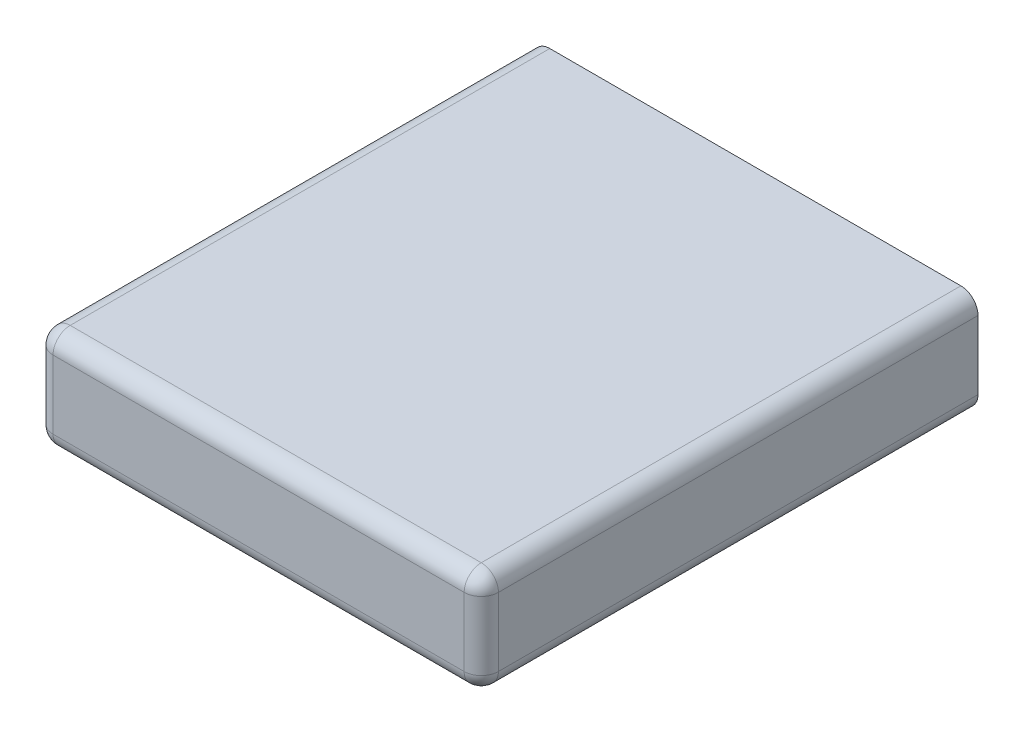
ISO-10303-21;
HEADER;
FILE_DESCRIPTION(('STEP AP214'),'2;1');
FILE_NAME('part.step','',(''),(''),'','','');
FILE_SCHEMA(('AUTOMOTIVE_DESIGN { 1 0 10303 214 1 1 1 1 }'));
ENDSEC;
DATA;
#1=APPLICATION_CONTEXT('core data for automotive mechanical design processes');
#2=APPLICATION_PROTOCOL_DEFINITION('international standard','automotive_design',2000,#1);
#3=PRODUCT_CONTEXT('',#1,'mechanical');
#4=PRODUCT('Part','Part','',(#3));
#5=PRODUCT_RELATED_PRODUCT_CATEGORY('part','',(#4));
#6=PRODUCT_DEFINITION_FORMATION('','',#4);
#7=PRODUCT_DEFINITION_CONTEXT('part definition',#1,'design');
#8=PRODUCT_DEFINITION('design','',#6,#7);
#9=PRODUCT_DEFINITION_SHAPE('','',#8);
#10=(LENGTH_UNIT() NAMED_UNIT(*) SI_UNIT(.MILLI.,.METRE.));
#11=(NAMED_UNIT(*) PLANE_ANGLE_UNIT() SI_UNIT($,.RADIAN.));
#12=(NAMED_UNIT(*) SI_UNIT($,.STERADIAN.) SOLID_ANGLE_UNIT());
#13=UNCERTAINTY_MEASURE_WITH_UNIT(LENGTH_MEASURE(1.E-05),#10,'distance_accuracy_value','');
#14=(GEOMETRIC_REPRESENTATION_CONTEXT(3) GLOBAL_UNCERTAINTY_ASSIGNED_CONTEXT((#13)) GLOBAL_UNIT_ASSIGNED_CONTEXT((#10,
#11,#12)) REPRESENTATION_CONTEXT('',''));
#15=CARTESIAN_POINT('',(0.,0.,0.));
#16=DIRECTION('',(0.,0.,1.));
#17=DIRECTION('',(1.,0.,0.));
#18=AXIS2_PLACEMENT_3D('',#15,#16,#17);
#19=CARTESIAN_POINT('',(12.,1.,21.5));
#20=DIRECTION('',(0.577350269189627,-0.577350269189628,0.577350269189622));
#21=DIRECTION('',(0.,0.707106781186544,0.707106781186551));
#22=AXIS2_PLACEMENT_3D('',#19,#20,#21);
#23=SPHERICAL_SURFACE('',#22,1.);
#24=CARTESIAN_POINT('',(12.5773502691896,0.422649730810372,22.0773502691896));
#25=VERTEX_POINT('',#24);
#26=VERTEX_LOOP('',#25);
#27=FACE_BOUND('',#26,.T.);
#28=CARTESIAN_POINT('',(12.,1.,21.5));
#29=DIRECTION('',(0.,0.,-1.));
#30=DIRECTION('',(-1.,0.,0.));
#31=AXIS2_PLACEMENT_3D('',#28,#29,#30);
#32=CIRCLE('',#31,1.);
#33=CARTESIAN_POINT('',(13.,1.,21.5));
#34=VERTEX_POINT('',#33);
#35=CARTESIAN_POINT('',(12.,0.,21.5));
#36=VERTEX_POINT('',#35);
#37=EDGE_CURVE('E112',#34,#36,#32,.T.);
#38=ORIENTED_EDGE('',*,*,#37,.F.);
#39=CARTESIAN_POINT('',(12.,1.,21.5));
#40=DIRECTION('',(0.,1.,0.));
#41=DIRECTION('',(0.,0.,1.));
#42=AXIS2_PLACEMENT_3D('',#39,#40,#41);
#43=CIRCLE('',#42,1.);
#44=CARTESIAN_POINT('',(12.,1.,22.5));
#45=VERTEX_POINT('',#44);
#46=EDGE_CURVE('E115',#45,#34,#43,.T.);
#47=ORIENTED_EDGE('',*,*,#46,.F.);
#48=CARTESIAN_POINT('',(12.,1.,21.5));
#49=DIRECTION('',(1.,0.,0.));
#50=DIRECTION('',(0.,0.,-1.));
#51=AXIS2_PLACEMENT_3D('',#48,#49,#50);
#52=CIRCLE('',#51,1.);
#53=EDGE_CURVE('E117',#36,#45,#52,.F.);
#54=ORIENTED_EDGE('',*,*,#53,.F.);
#55=EDGE_LOOP('',(#38,#47,#54));
#56=FACE_BOUND('',#55,.T.);
#57=ADVANCED_FACE('F17',(#27,#56),#23,.T.);
#58=CARTESIAN_POINT('',(-12.,1.,21.5));
#59=DIRECTION('',(-0.577350269189628,-0.577350269189627,0.577350269189622));
#60=DIRECTION('',(-0.707106781186547,0.707106781186548,0.));
#61=AXIS2_PLACEMENT_3D('',#58,#59,#60);
#62=SPHERICAL_SURFACE('',#61,1.);
#63=CARTESIAN_POINT('',(-12.5773502691896,0.422649730810373,22.0773502691896));
#64=VERTEX_POINT('',#63);
#65=VERTEX_LOOP('',#64);
#66=FACE_BOUND('',#65,.T.);
#67=CARTESIAN_POINT('',(-12.,1.,21.5));
#68=DIRECTION('',(0.,0.,1.));
#69=DIRECTION('',(1.,0.,0.));
#70=AXIS2_PLACEMENT_3D('',#67,#68,#69);
#71=CIRCLE('',#70,1.);
#72=CARTESIAN_POINT('',(-12.,0.,21.5));
#73=VERTEX_POINT('',#72);
#74=CARTESIAN_POINT('',(-13.,1.,21.5));
#75=VERTEX_POINT('',#74);
#76=EDGE_CURVE('E220',#73,#75,#71,.F.);
#77=ORIENTED_EDGE('',*,*,#76,.F.);
#78=CARTESIAN_POINT('',(-12.,1.,21.5));
#79=DIRECTION('',(1.,0.,0.));
#80=DIRECTION('',(0.,0.,-1.));
#81=AXIS2_PLACEMENT_3D('',#78,#79,#80);
#82=CIRCLE('',#81,1.);
#83=CARTESIAN_POINT('',(-12.,1.,22.5));
#84=VERTEX_POINT('',#83);
#85=EDGE_CURVE('E224',#84,#73,#82,.T.);
#86=ORIENTED_EDGE('',*,*,#85,.F.);
#87=CARTESIAN_POINT('',(-12.,1.,21.5));
#88=DIRECTION('',(0.,1.,0.));
#89=DIRECTION('',(0.,0.,1.));
#90=AXIS2_PLACEMENT_3D('',#87,#88,#89);
#91=CIRCLE('',#90,1.);
#92=EDGE_CURVE('E21',#75,#84,#91,.T.);
#93=ORIENTED_EDGE('',*,*,#92,.F.);
#94=EDGE_LOOP('',(#77,#86,#93));
#95=FACE_BOUND('',#94,.T.);
#96=ADVANCED_FACE('F110',(#66,#95),#62,.T.);
#97=CARTESIAN_POINT('',(-12.,0.,21.5));
#98=DIRECTION('',(0.,1.,0.));
#99=DIRECTION('',(0.,0.,1.));
#100=AXIS2_PLACEMENT_3D('',#97,#98,#99);
#101=CYLINDRICAL_SURFACE('',#100,1.);
#102=ORIENTED_EDGE('',*,*,#92,.T.);
#103=DIRECTION('',(0.,1.,0.));
#104=VECTOR('',#103,1.);
#105=CARTESIAN_POINT('',(-12.,0.,22.5));
#106=LINE('',#105,#104);
#107=CARTESIAN_POINT('',(-12.,5.,22.5));
#108=VERTEX_POINT('',#107);
#109=EDGE_CURVE('E216',#108,#84,#106,.F.);
#110=ORIENTED_EDGE('',*,*,#109,.F.);
#111=CARTESIAN_POINT('',(-12.,5.,21.5));
#112=DIRECTION('',(0.,1.,0.));
#113=DIRECTION('',(0.,0.,1.));
#114=AXIS2_PLACEMENT_3D('',#111,#112,#113);
#115=CIRCLE('',#114,1.);
#116=CARTESIAN_POINT('',(-13.,5.,21.5));
#117=VERTEX_POINT('',#116);
#118=EDGE_CURVE('E217',#117,#108,#115,.T.);
#119=ORIENTED_EDGE('',*,*,#118,.F.);
#120=DIRECTION('',(0.,1.,0.));
#121=VECTOR('',#120,1.);
#122=CARTESIAN_POINT('',(-13.,0.,21.5));
#123=LINE('',#122,#121);
#124=EDGE_CURVE('E133',#75,#117,#123,.T.);
#125=ORIENTED_EDGE('',*,*,#124,.F.);
#126=EDGE_LOOP('',(#102,#110,#119,#125));
#127=FACE_BOUND('',#126,.T.);
#128=ADVANCED_FACE('F185',(#127),#101,.T.);
#129=CARTESIAN_POINT('',(12.,0.,21.5));
#130=DIRECTION('',(0.,1.,0.));
#131=DIRECTION('',(0.,0.,1.));
#132=AXIS2_PLACEMENT_3D('',#129,#130,#131);
#133=CYLINDRICAL_SURFACE('',#132,1.);
#134=ORIENTED_EDGE('',*,*,#46,.T.);
#135=DIRECTION('',(0.,1.,0.));
#136=VECTOR('',#135,1.);
#137=CARTESIAN_POINT('',(13.,0.,21.5));
#138=LINE('',#137,#136);
#139=CARTESIAN_POINT('',(13.,5.,21.5));
#140=VERTEX_POINT('',#139);
#141=EDGE_CURVE('E132',#140,#34,#138,.F.);
#142=ORIENTED_EDGE('',*,*,#141,.F.);
#143=CARTESIAN_POINT('',(12.,5.,21.5));
#144=DIRECTION('',(0.,1.,0.));
#145=DIRECTION('',(0.,0.,1.));
#146=AXIS2_PLACEMENT_3D('',#143,#144,#145);
#147=CIRCLE('',#146,1.);
#148=CARTESIAN_POINT('',(12.,5.,22.5));
#149=VERTEX_POINT('',#148);
#150=EDGE_CURVE('E214',#149,#140,#147,.T.);
#151=ORIENTED_EDGE('',*,*,#150,.F.);
#152=DIRECTION('',(0.,1.,0.));
#153=VECTOR('',#152,1.);
#154=CARTESIAN_POINT('',(12.,0.,22.5));
#155=LINE('',#154,#153);
#156=EDGE_CURVE('E140',#45,#149,#155,.T.);
#157=ORIENTED_EDGE('',*,*,#156,.F.);
#158=EDGE_LOOP('',(#134,#142,#151,#157));
#159=FACE_BOUND('',#158,.T.);
#160=ADVANCED_FACE('F137',(#159),#133,.T.);
#161=CARTESIAN_POINT('',(-6.5,1.,21.5));
#162=DIRECTION('',(1.,0.,0.));
#163=DIRECTION('',(0.,0.,-1.));
#164=AXIS2_PLACEMENT_3D('',#161,#162,#163);
#165=CYLINDRICAL_SURFACE('',#164,1.);
#166=ORIENTED_EDGE('',*,*,#85,.T.);
#167=DIRECTION('',(1.,0.,0.));
#168=VECTOR('',#167,1.);
#169=CARTESIAN_POINT('',(0.,0.,21.5));
#170=LINE('',#169,#168);
#171=EDGE_CURVE('E146',#73,#36,#170,.T.);
#172=ORIENTED_EDGE('',*,*,#171,.T.);
#173=ORIENTED_EDGE('',*,*,#53,.T.);
#174=DIRECTION('',(1.,0.,0.));
#175=VECTOR('',#174,1.);
#176=CARTESIAN_POINT('',(-13.,1.,22.5));
#177=LINE('',#176,#175);
#178=EDGE_CURVE('E192',#84,#45,#177,.T.);
#179=ORIENTED_EDGE('',*,*,#178,.F.);
#180=EDGE_LOOP('',(#166,#172,#173,#179));
#181=FACE_BOUND('',#180,.T.);
#182=ADVANCED_FACE('F179',(#181),#165,.T.);
#183=CARTESIAN_POINT('',(12.,1.,15.25));
#184=DIRECTION('',(0.,0.,-1.));
#185=DIRECTION('',(-1.,0.,0.));
#186=AXIS2_PLACEMENT_3D('',#183,#184,#185);
#187=CYLINDRICAL_SURFACE('',#186,1.);
#188=ORIENTED_EDGE('',*,*,#37,.T.);
#189=DIRECTION('',(0.,0.,1.));
#190=VECTOR('',#189,1.);
#191=CARTESIAN_POINT('',(12.,0.,8.));
#192=LINE('',#191,#190);
#193=CARTESIAN_POINT('',(12.,0.,-6.5));
#194=VERTEX_POINT('',#193);
#195=EDGE_CURVE('E148',#36,#194,#192,.F.);
#196=ORIENTED_EDGE('',*,*,#195,.T.);
#197=CARTESIAN_POINT('',(12.,1.,-6.5));
#198=DIRECTION('',(0.,0.,-1.));
#199=DIRECTION('',(-1.,0.,0.));
#200=AXIS2_PLACEMENT_3D('',#197,#198,#199);
#201=CIRCLE('',#200,1.);
#202=CARTESIAN_POINT('',(13.,1.,-6.5));
#203=VERTEX_POINT('',#202);
#204=EDGE_CURVE('E123',#194,#203,#201,.F.);
#205=ORIENTED_EDGE('',*,*,#204,.T.);
#206=DIRECTION('',(0.,0.,-1.));
#207=VECTOR('',#206,1.);
#208=CARTESIAN_POINT('',(13.,1.,22.5));
#209=LINE('',#208,#207);
#210=EDGE_CURVE('E126',#34,#203,#209,.T.);
#211=ORIENTED_EDGE('',*,*,#210,.F.);
#212=EDGE_LOOP('',(#188,#196,#205,#211));
#213=FACE_BOUND('',#212,.T.);
#214=ADVANCED_FACE('F127',(#213),#187,.T.);
#215=CARTESIAN_POINT('',(-12.,1.,0.75));
#216=DIRECTION('',(0.,0.,1.));
#217=DIRECTION('',(1.,0.,0.));
#218=AXIS2_PLACEMENT_3D('',#215,#216,#217);
#219=CYLINDRICAL_SURFACE('',#218,1.);
#220=ORIENTED_EDGE('',*,*,#76,.T.);
#221=DIRECTION('',(0.,0.,1.));
#222=VECTOR('',#221,1.);
#223=CARTESIAN_POINT('',(-13.,1.,-6.5));
#224=LINE('',#223,#222);
#225=CARTESIAN_POINT('',(-13.,1.,-6.5));
#226=VERTEX_POINT('',#225);
#227=EDGE_CURVE('E152',#226,#75,#224,.T.);
#228=ORIENTED_EDGE('',*,*,#227,.F.);
#229=CARTESIAN_POINT('',(-12.,1.,-6.5));
#230=DIRECTION('',(0.,0.,1.));
#231=DIRECTION('',(1.,0.,0.));
#232=AXIS2_PLACEMENT_3D('',#229,#230,#231);
#233=CIRCLE('',#232,1.);
#234=CARTESIAN_POINT('',(-12.,0.,-6.5));
#235=VERTEX_POINT('',#234);
#236=EDGE_CURVE('E122',#226,#235,#233,.T.);
#237=ORIENTED_EDGE('',*,*,#236,.T.);
#238=DIRECTION('',(0.,0.,1.));
#239=VECTOR('',#238,1.);
#240=CARTESIAN_POINT('',(-12.,0.,8.));
#241=LINE('',#240,#239);
#242=EDGE_CURVE('E234',#235,#73,#241,.T.);
#243=ORIENTED_EDGE('',*,*,#242,.T.);
#244=EDGE_LOOP('',(#220,#228,#237,#243));
#245=FACE_BOUND('',#244,.T.);
#246=ADVANCED_FACE('F172',(#245),#219,.T.);
#247=CARTESIAN_POINT('',(-12.,5.,21.5));
#248=DIRECTION('',(-0.577350269189625,0.577350269189624,0.577350269189629));
#249=DIRECTION('',(-0.70710678118655,0.,-0.707106781186545));
#250=AXIS2_PLACEMENT_3D('',#247,#248,#249);
#251=SPHERICAL_SURFACE('',#250,1.);
#252=CARTESIAN_POINT('',(-12.5773502691896,5.57735026918962,22.0773502691896));
#253=VERTEX_POINT('',#252);
#254=VERTEX_LOOP('',#253);
#255=FACE_BOUND('',#254,.T.);
#256=ORIENTED_EDGE('',*,*,#118,.T.);
#257=CARTESIAN_POINT('',(-12.,5.,21.5));
#258=DIRECTION('',(1.,0.,0.));
#259=DIRECTION('',(0.,0.,-1.));
#260=AXIS2_PLACEMENT_3D('',#257,#258,#259);
#261=CIRCLE('',#260,1.);
#262=CARTESIAN_POINT('',(-12.,6.,21.5));
#263=VERTEX_POINT('',#262);
#264=EDGE_CURVE('E204',#263,#108,#261,.T.);
#265=ORIENTED_EDGE('',*,*,#264,.F.);
#266=CARTESIAN_POINT('',(-12.,5.,21.5));
#267=DIRECTION('',(0.,0.,1.));
#268=DIRECTION('',(1.,0.,0.));
#269=AXIS2_PLACEMENT_3D('',#266,#267,#268);
#270=CIRCLE('',#269,1.);
#271=EDGE_CURVE('E210',#117,#263,#270,.F.);
#272=ORIENTED_EDGE('',*,*,#271,.F.);
#273=EDGE_LOOP('',(#256,#265,#272));
#274=FACE_BOUND('',#273,.T.);
#275=ADVANCED_FACE('F168',(#255,#274),#251,.T.);
#276=CARTESIAN_POINT('',(-13.,0.,22.5));
#277=DIRECTION('',(0.,0.,1.));
#278=DIRECTION('',(1.,0.,0.));
#279=AXIS2_PLACEMENT_3D('',#276,#277,#278);
#280=PLANE('',#279);
#281=DIRECTION('',(1.,0.,0.));
#282=VECTOR('',#281,1.);
#283=CARTESIAN_POINT('',(-6.5,5.,22.5));
#284=LINE('',#283,#282);
#285=EDGE_CURVE('E203',#108,#149,#284,.T.);
#286=ORIENTED_EDGE('',*,*,#285,.F.);
#287=ORIENTED_EDGE('',*,*,#109,.T.);
#288=ORIENTED_EDGE('',*,*,#178,.T.);
#289=ORIENTED_EDGE('',*,*,#156,.T.);
#290=EDGE_LOOP('',(#286,#287,#288,#289));
#291=FACE_BOUND('',#290,.T.);
#292=ADVANCED_FACE('F164',(#291),#280,.T.);
#293=CARTESIAN_POINT('',(12.,5.,21.5));
#294=DIRECTION('',(0.577350269189628,0.577350269189626,0.577350269189623));
#295=DIRECTION('',(0.707106781186546,-0.707106781186549,0.));
#296=AXIS2_PLACEMENT_3D('',#293,#294,#295);
#297=SPHERICAL_SURFACE('',#296,1.);
#298=CARTESIAN_POINT('',(12.5773502691896,5.57735026918963,22.0773502691896));
#299=VERTEX_POINT('',#298);
#300=VERTEX_LOOP('',#299);
#301=FACE_BOUND('',#300,.T.);
#302=ORIENTED_EDGE('',*,*,#150,.T.);
#303=CARTESIAN_POINT('',(12.,5.,21.5));
#304=DIRECTION('',(0.,0.,-1.));
#305=DIRECTION('',(-1.,0.,0.));
#306=AXIS2_PLACEMENT_3D('',#303,#304,#305);
#307=CIRCLE('',#306,1.);
#308=CARTESIAN_POINT('',(12.,6.,21.5));
#309=VERTEX_POINT('',#308);
#310=EDGE_CURVE('E201',#309,#140,#307,.T.);
#311=ORIENTED_EDGE('',*,*,#310,.F.);
#312=CARTESIAN_POINT('',(12.,5.,21.5));
#313=DIRECTION('',(1.,0.,0.));
#314=DIRECTION('',(0.,0.,-1.));
#315=AXIS2_PLACEMENT_3D('',#312,#313,#314);
#316=CIRCLE('',#315,1.);
#317=EDGE_CURVE('E207',#149,#309,#316,.F.);
#318=ORIENTED_EDGE('',*,*,#317,.F.);
#319=EDGE_LOOP('',(#302,#311,#318));
#320=FACE_BOUND('',#319,.T.);
#321=ADVANCED_FACE('F159',(#301,#320),#297,.T.);
#322=CARTESIAN_POINT('',(-13.,0.,-6.5));
#323=DIRECTION('',(-1.,0.,0.));
#324=DIRECTION('',(0.,0.,1.));
#325=AXIS2_PLACEMENT_3D('',#322,#323,#324);
#326=PLANE('',#325);
#327=DIRECTION('',(0.,0.,1.));
#328=VECTOR('',#327,1.);
#329=CARTESIAN_POINT('',(-13.,5.,0.75));
#330=LINE('',#329,#328);
#331=CARTESIAN_POINT('',(-13.,5.,-6.5));
#332=VERTEX_POINT('',#331);
#333=EDGE_CURVE('E213',#332,#117,#330,.T.);
#334=ORIENTED_EDGE('',*,*,#333,.F.);
#335=DIRECTION('',(0.,1.,0.));
#336=VECTOR('',#335,1.);
#337=CARTESIAN_POINT('',(-13.,0.,-6.5));
#338=LINE('',#337,#336);
#339=EDGE_CURVE('E200',#226,#332,#338,.T.);
#340=ORIENTED_EDGE('',*,*,#339,.F.);
#341=ORIENTED_EDGE('',*,*,#227,.T.);
#342=ORIENTED_EDGE('',*,*,#124,.T.);
#343=EDGE_LOOP('',(#334,#340,#341,#342));
#344=FACE_BOUND('',#343,.T.);
#345=ADVANCED_FACE('F163',(#344),#326,.T.);
#346=CARTESIAN_POINT('',(13.,0.,22.5));
#347=DIRECTION('',(1.,0.,0.));
#348=DIRECTION('',(0.,0.,-1.));
#349=AXIS2_PLACEMENT_3D('',#346,#347,#348);
#350=PLANE('',#349);
#351=DIRECTION('',(0.,0.,-1.));
#352=VECTOR('',#351,1.);
#353=CARTESIAN_POINT('',(13.,5.,15.25));
#354=LINE('',#353,#352);
#355=CARTESIAN_POINT('',(13.,5.,-6.5));
#356=VERTEX_POINT('',#355);
#357=EDGE_CURVE('E144',#140,#356,#354,.T.);
#358=ORIENTED_EDGE('',*,*,#357,.F.);
#359=ORIENTED_EDGE('',*,*,#141,.T.);
#360=ORIENTED_EDGE('',*,*,#210,.T.);
#361=DIRECTION('',(0.,1.,0.));
#362=VECTOR('',#361,1.);
#363=CARTESIAN_POINT('',(13.,0.,-6.5));
#364=LINE('',#363,#362);
#365=EDGE_CURVE('E196',#356,#203,#364,.F.);
#366=ORIENTED_EDGE('',*,*,#365,.F.);
#367=EDGE_LOOP('',(#358,#359,#360,#366));
#368=FACE_BOUND('',#367,.T.);
#369=ADVANCED_FACE('F143',(#368),#350,.T.);
#370=CARTESIAN_POINT('',(0.,0.,8.));
#371=DIRECTION('',(0.,1.,0.));
#372=DIRECTION('',(0.,0.,1.));
#373=AXIS2_PLACEMENT_3D('',#370,#371,#372);
#374=PLANE('',#373);
#375=DIRECTION('',(-1.,0.,0.));
#376=VECTOR('',#375,1.);
#377=CARTESIAN_POINT('',(13.,0.,-6.5));
#378=LINE('',#377,#376);
#379=EDGE_CURVE('E236',#194,#235,#378,.T.);
#380=ORIENTED_EDGE('',*,*,#379,.F.);
#381=ORIENTED_EDGE('',*,*,#195,.F.);
#382=ORIENTED_EDGE('',*,*,#171,.F.);
#383=ORIENTED_EDGE('',*,*,#242,.F.);
#384=EDGE_LOOP('',(#380,#381,#382,#383));
#385=FACE_BOUND('',#384,.T.);
#386=ADVANCED_FACE('F233',(#385),#374,.F.);
#387=CARTESIAN_POINT('',(-12.,5.,0.75));
#388=DIRECTION('',(0.,0.,1.));
#389=DIRECTION('',(1.,0.,0.));
#390=AXIS2_PLACEMENT_3D('',#387,#388,#389);
#391=CYLINDRICAL_SURFACE('',#390,1.);
#392=ORIENTED_EDGE('',*,*,#271,.T.);
#393=DIRECTION('',(0.,0.,1.));
#394=VECTOR('',#393,1.);
#395=CARTESIAN_POINT('',(-12.,6.,8.));
#396=LINE('',#395,#394);
#397=CARTESIAN_POINT('',(-12.,6.,-6.5));
#398=VERTEX_POINT('',#397);
#399=EDGE_CURVE('E267',#398,#263,#396,.T.);
#400=ORIENTED_EDGE('',*,*,#399,.F.);
#401=CARTESIAN_POINT('',(-12.,5.,-6.5));
#402=DIRECTION('',(0.,0.,1.));
#403=DIRECTION('',(1.,0.,0.));
#404=AXIS2_PLACEMENT_3D('',#401,#402,#403);
#405=CIRCLE('',#404,1.);
#406=EDGE_CURVE('E197',#332,#398,#405,.F.);
#407=ORIENTED_EDGE('',*,*,#406,.F.);
#408=ORIENTED_EDGE('',*,*,#333,.T.);
#409=EDGE_LOOP('',(#392,#400,#407,#408));
#410=FACE_BOUND('',#409,.T.);
#411=ADVANCED_FACE('F246',(#410),#391,.T.);
#412=CARTESIAN_POINT('',(-6.5,5.,21.5));
#413=DIRECTION('',(1.,0.,0.));
#414=DIRECTION('',(0.,0.,-1.));
#415=AXIS2_PLACEMENT_3D('',#412,#413,#414);
#416=CYLINDRICAL_SURFACE('',#415,1.);
#417=ORIENTED_EDGE('',*,*,#264,.T.);
#418=ORIENTED_EDGE('',*,*,#285,.T.);
#419=ORIENTED_EDGE('',*,*,#317,.T.);
#420=DIRECTION('',(1.,0.,0.));
#421=VECTOR('',#420,1.);
#422=CARTESIAN_POINT('',(0.,6.,21.5));
#423=LINE('',#422,#421);
#424=EDGE_CURVE('E240',#263,#309,#423,.T.);
#425=ORIENTED_EDGE('',*,*,#424,.F.);
#426=EDGE_LOOP('',(#417,#418,#419,#425));
#427=FACE_BOUND('',#426,.T.);
#428=ADVANCED_FACE('F261',(#427),#416,.T.);
#429=CARTESIAN_POINT('',(12.,5.,15.25));
#430=DIRECTION('',(0.,0.,-1.));
#431=DIRECTION('',(-1.,0.,0.));
#432=AXIS2_PLACEMENT_3D('',#429,#430,#431);
#433=CYLINDRICAL_SURFACE('',#432,1.);
#434=ORIENTED_EDGE('',*,*,#310,.T.);
#435=ORIENTED_EDGE('',*,*,#357,.T.);
#436=CARTESIAN_POINT('',(12.,5.,-6.5));
#437=DIRECTION('',(0.,0.,-1.));
#438=DIRECTION('',(-1.,0.,0.));
#439=AXIS2_PLACEMENT_3D('',#436,#437,#438);
#440=CIRCLE('',#439,1.);
#441=CARTESIAN_POINT('',(12.,6.,-6.5));
#442=VERTEX_POINT('',#441);
#443=EDGE_CURVE('E36',#442,#356,#440,.T.);
#444=ORIENTED_EDGE('',*,*,#443,.F.);
#445=DIRECTION('',(0.,0.,1.));
#446=VECTOR('',#445,1.);
#447=CARTESIAN_POINT('',(12.,6.,8.));
#448=LINE('',#447,#446);
#449=EDGE_CURVE('E27',#309,#442,#448,.F.);
#450=ORIENTED_EDGE('',*,*,#449,.F.);
#451=EDGE_LOOP('',(#434,#435,#444,#450));
#452=FACE_BOUND('',#451,.T.);
#453=ADVANCED_FACE('F275',(#452),#433,.T.);
#454=CARTESIAN_POINT('',(13.,0.,-6.5));
#455=DIRECTION('',(0.,0.,-1.));
#456=DIRECTION('',(-1.,0.,0.));
#457=AXIS2_PLACEMENT_3D('',#454,#455,#456);
#458=PLANE('',#457);
#459=ORIENTED_EDGE('',*,*,#204,.F.);
#460=ORIENTED_EDGE('',*,*,#379,.T.);
#461=ORIENTED_EDGE('',*,*,#236,.F.);
#462=ORIENTED_EDGE('',*,*,#339,.T.);
#463=ORIENTED_EDGE('',*,*,#406,.T.);
#464=DIRECTION('',(1.,0.,0.));
#465=VECTOR('',#464,1.);
#466=CARTESIAN_POINT('',(0.,6.,-6.5));
#467=LINE('',#466,#465);
#468=EDGE_CURVE('E11',#442,#398,#467,.F.);
#469=ORIENTED_EDGE('',*,*,#468,.F.);
#470=ORIENTED_EDGE('',*,*,#443,.T.);
#471=ORIENTED_EDGE('',*,*,#365,.T.);
#472=EDGE_LOOP('',(#459,#460,#461,#462,#463,#469,#470,#471));
#473=FACE_BOUND('',#472,.T.);
#474=ADVANCED_FACE('F274',(#473),#458,.T.);
#475=CARTESIAN_POINT('',(0.,6.,8.));
#476=DIRECTION('',(0.,1.,0.));
#477=DIRECTION('',(0.,0.,1.));
#478=AXIS2_PLACEMENT_3D('',#475,#476,#477);
#479=PLANE('',#478);
#480=ORIENTED_EDGE('',*,*,#449,.T.);
#481=ORIENTED_EDGE('',*,*,#468,.T.);
#482=ORIENTED_EDGE('',*,*,#399,.T.);
#483=ORIENTED_EDGE('',*,*,#424,.T.);
#484=EDGE_LOOP('',(#480,#481,#482,#483));
#485=FACE_BOUND('',#484,.T.);
#486=ADVANCED_FACE('F268',(#485),#479,.T.);
#487=CLOSED_SHELL('',(#57,#96,#128,#160,#182,#214,#246,#275,#292,#321,#345,#369,#386,#411,#428,
#453,#474,#486));
#488=MANIFOLD_SOLID_BREP('B1',#487);
#489=ADVANCED_BREP_SHAPE_REPRESENTATION('',(#18,#488),#14);
#490=SHAPE_DEFINITION_REPRESENTATION(#9,#489);
ENDSEC;
END-ISO-10303-21;
